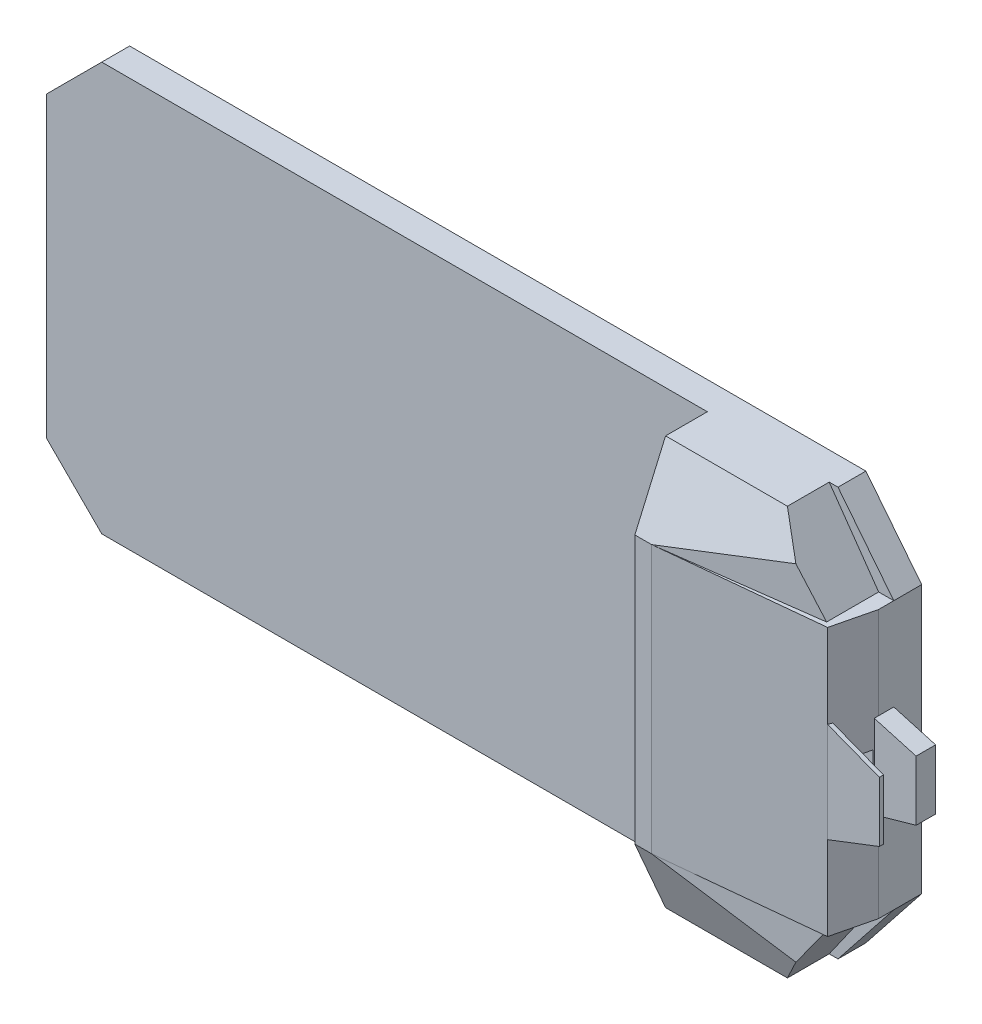
ISO-10303-21;
HEADER;
FILE_DESCRIPTION(('STEP AP214'),'2;1');
FILE_NAME('part.step','',(''),(''),'','','');
FILE_SCHEMA(('AUTOMOTIVE_DESIGN { 1 0 10303 214 1 1 1 1 }'));
ENDSEC;
DATA;
#1=APPLICATION_CONTEXT('core data for automotive mechanical design processes');
#2=APPLICATION_PROTOCOL_DEFINITION('international standard','automotive_design',2000,#1);
#3=PRODUCT_CONTEXT('',#1,'mechanical');
#4=PRODUCT('Part','Part','',(#3));
#5=PRODUCT_RELATED_PRODUCT_CATEGORY('part','',(#4));
#6=PRODUCT_DEFINITION_FORMATION('','',#4);
#7=PRODUCT_DEFINITION_CONTEXT('part definition',#1,'design');
#8=PRODUCT_DEFINITION('design','',#6,#7);
#9=PRODUCT_DEFINITION_SHAPE('','',#8);
#10=(LENGTH_UNIT() NAMED_UNIT(*) SI_UNIT(.MILLI.,.METRE.));
#11=(NAMED_UNIT(*) PLANE_ANGLE_UNIT() SI_UNIT($,.RADIAN.));
#12=(NAMED_UNIT(*) SI_UNIT($,.STERADIAN.) SOLID_ANGLE_UNIT());
#13=UNCERTAINTY_MEASURE_WITH_UNIT(LENGTH_MEASURE(1.E-05),#10,'distance_accuracy_value','');
#14=(GEOMETRIC_REPRESENTATION_CONTEXT(3) GLOBAL_UNCERTAINTY_ASSIGNED_CONTEXT((#13)) GLOBAL_UNIT_ASSIGNED_CONTEXT((#10,
#11,#12)) REPRESENTATION_CONTEXT('',''));
#15=CARTESIAN_POINT('',(0.,0.,0.));
#16=DIRECTION('',(0.,0.,1.));
#17=DIRECTION('',(1.,0.,0.));
#18=AXIS2_PLACEMENT_3D('',#15,#16,#17);
#19=CARTESIAN_POINT('',(1520.,480.,154.516976287061));
#20=DIRECTION('',(-0.971865662089476,0.,-0.235535846213236));
#21=DIRECTION('',(-0.235535846213236,0.,0.971865662089476));
#22=AXIS2_PLACEMENT_3D('',#19,#20,#21);
#23=PLANE('',#22);
#24=DIRECTION('',(-0.235535846213236,0.,0.971865662089476));
#25=VECTOR('',#24,1.);
#26=CARTESIAN_POINT('',(1520.,49.9999999999998,154.516976287061));
#27=LINE('',#26,#25);
#28=CARTESIAN_POINT('',(1516.24762224408,49.9999999999999,170.));
#29=VERTEX_POINT('',#28);
#30=CARTESIAN_POINT('',(1487.96391181185,50.,286.703964205424));
#31=VERTEX_POINT('',#30);
#32=EDGE_CURVE('E273',#29,#31,#27,.T.);
#33=ORIENTED_EDGE('',*,*,#32,.F.);
#34=DIRECTION('',(0.,-1.,0.));
#35=VECTOR('',#34,1.);
#36=CARTESIAN_POINT('',(1516.24762224408,480.,170.));
#37=LINE('',#36,#35);
#38=CARTESIAN_POINT('',(1516.24762224408,-50.0000000000001,170.));
#39=VERTEX_POINT('',#38);
#40=EDGE_CURVE('E282',#29,#39,#37,.T.);
#41=ORIENTED_EDGE('',*,*,#40,.T.);
#42=DIRECTION('',(0.235535846213236,0.,-0.971865662089476));
#43=VECTOR('',#42,1.);
#44=CARTESIAN_POINT('',(1520.,-50.0000000000002,154.516976287061));
#45=LINE('',#44,#43);
#46=CARTESIAN_POINT('',(1487.96391181185,-50.0000000000001,286.703964205424));
#47=VERTEX_POINT('',#46);
#48=EDGE_CURVE('E271',#47,#39,#45,.T.);
#49=ORIENTED_EDGE('',*,*,#48,.F.);
#50=DIRECTION('',(0.,1.,0.));
#51=VECTOR('',#50,1.);
#52=CARTESIAN_POINT('',(1487.96391181185,480.,286.703964205424));
#53=LINE('',#52,#51);
#54=CARTESIAN_POINT('',(1487.96391181185,-177.53371811243,286.703964205424));
#55=VERTEX_POINT('',#54);
#56=EDGE_CURVE('E266',#55,#47,#53,.T.);
#57=ORIENTED_EDGE('',*,*,#56,.F.);
#58=DIRECTION('',(-0.23457473015928,-0.0902466136895594,0.967899914602883));
#59=VECTOR('',#58,1.);
#60=CARTESIAN_POINT('',(1513.33600098474,-167.772457261663,182.013902632881));
#61=LINE('',#60,#59);
#62=CARTESIAN_POINT('',(1484.32859694169,-178.932312310983,301.703964205424));
#63=VERTEX_POINT('',#62);
#64=EDGE_CURVE('E383',#55,#63,#61,.T.);
#65=ORIENTED_EDGE('',*,*,#64,.T.);
#66=DIRECTION('',(0.,1.,0.));
#67=VECTOR('',#66,1.);
#68=CARTESIAN_POINT('',(1484.32859694169,-480.,301.703964205424));
#69=LINE('',#68,#67);
#70=CARTESIAN_POINT('',(1484.32859694169,-480.,301.703964205424));
#71=VERTEX_POINT('',#70);
#72=EDGE_CURVE('E341',#71,#63,#69,.T.);
#73=ORIENTED_EDGE('',*,*,#72,.F.);
#74=DIRECTION('',(0.235535846213236,0.,-0.971865662089476));
#75=VECTOR('',#74,1.);
#76=CARTESIAN_POINT('',(1520.,-480.,154.516976287061));
#77=LINE('',#76,#75);
#78=CARTESIAN_POINT('',(1520.,-480.,154.516976287061));
#79=VERTEX_POINT('',#78);
#80=EDGE_CURVE('E332',#71,#79,#77,.T.);
#81=ORIENTED_EDGE('',*,*,#80,.T.);
#82=DIRECTION('',(0.,1.,0.));
#83=VECTOR('',#82,1.);
#84=CARTESIAN_POINT('',(1520.,-480.,154.516976287061));
#85=LINE('',#84,#83);
#86=CARTESIAN_POINT('',(1520.,-150.,154.516976287061));
#87=VERTEX_POINT('',#86);
#88=EDGE_CURVE('E338',#79,#87,#85,.T.);
#89=ORIENTED_EDGE('',*,*,#88,.T.);
#90=DIRECTION('',(0.,-1.,0.));
#91=VECTOR('',#90,1.);
#92=CARTESIAN_POINT('',(1520.,480.,154.516976287061));
#93=LINE('',#92,#91);
#94=CARTESIAN_POINT('',(1520.,150.,154.516976287061));
#95=VERTEX_POINT('',#94);
#96=EDGE_CURVE('E449',#95,#87,#93,.T.);
#97=ORIENTED_EDGE('',*,*,#96,.F.);
#98=CARTESIAN_POINT('',(1520.,480.,154.516976287061));
#99=VERTEX_POINT('',#98);
#100=EDGE_CURVE('E450',#99,#95,#93,.T.);
#101=ORIENTED_EDGE('',*,*,#100,.F.);
#102=DIRECTION('',(0.235535846213236,0.,-0.971865662089476));
#103=VECTOR('',#102,1.);
#104=CARTESIAN_POINT('',(1520.,480.,154.516976287061));
#105=LINE('',#104,#103);
#106=CARTESIAN_POINT('',(1484.32859694169,480.,301.703964205424));
#107=VERTEX_POINT('',#106);
#108=EDGE_CURVE('E444',#107,#99,#105,.T.);
#109=ORIENTED_EDGE('',*,*,#108,.F.);
#110=DIRECTION('',(0.,-1.,0.));
#111=VECTOR('',#110,1.);
#112=CARTESIAN_POINT('',(1484.32859694169,480.,301.703964205424));
#113=LINE('',#112,#111);
#114=CARTESIAN_POINT('',(1484.32859694169,178.932312310983,301.703964205424));
#115=VERTEX_POINT('',#114);
#116=EDGE_CURVE('E454',#107,#115,#113,.T.);
#117=ORIENTED_EDGE('',*,*,#116,.T.);
#118=DIRECTION('',(-0.23457473015928,0.0902466136895594,0.967899914602883));
#119=VECTOR('',#118,1.);
#120=CARTESIAN_POINT('',(1513.33600098474,167.772457261663,182.013902632881));
#121=LINE('',#120,#119);
#122=CARTESIAN_POINT('',(1487.96391181185,177.53371811243,286.703964205424));
#123=VERTEX_POINT('',#122);
#124=EDGE_CURVE('E48',#123,#115,#121,.T.);
#125=ORIENTED_EDGE('',*,*,#124,.F.);
#126=EDGE_CURVE('E505',#31,#123,#53,.T.);
#127=ORIENTED_EDGE('',*,*,#126,.F.);
#128=EDGE_LOOP('',(#33,#41,#49,#57,#65,#73,#81,#89,#97,#101,#109,#117,#125,#127));
#129=FACE_BOUND('',#128,.T.);
#130=ADVANCED_FACE('F40',(#129),#23,.F.);
#131=CARTESIAN_POINT('',(-1320.,732.5,100.));
#132=DIRECTION('',(0.,-1.,0.));
#133=DIRECTION('',(1.,0.,0.));
#134=AXIS2_PLACEMENT_3D('',#131,#132,#133);
#135=PLANE('',#134);
#136=DIRECTION('',(-1.,0.,0.));
#137=VECTOR('',#136,1.);
#138=CARTESIAN_POINT('',(-1320.,732.5,100.));
#139=LINE('',#138,#137);
#140=CARTESIAN_POINT('',(1320.,732.5,100.));
#141=VERTEX_POINT('',#140);
#142=CARTESIAN_POINT('',(1288.45260963228,732.5,100.));
#143=VERTEX_POINT('',#142);
#144=EDGE_CURVE('E391',#141,#143,#139,.T.);
#145=ORIENTED_EDGE('',*,*,#144,.F.);
#146=DIRECTION('',(0.,0.,-1.));
#147=VECTOR('',#146,1.);
#148=CARTESIAN_POINT('',(1320.,732.5,100.));
#149=LINE('',#148,#147);
#150=CARTESIAN_POINT('',(1320.,732.5,0.));
#151=VERTEX_POINT('',#150);
#152=EDGE_CURVE('E499',#141,#151,#149,.T.);
#153=ORIENTED_EDGE('',*,*,#152,.T.);
#154=DIRECTION('',(-1.,0.,0.));
#155=VECTOR('',#154,1.);
#156=CARTESIAN_POINT('',(-1320.,732.5,0.));
#157=LINE('',#156,#155);
#158=CARTESIAN_POINT('',(-1320.,732.5,0.));
#159=VERTEX_POINT('',#158);
#160=EDGE_CURVE('E489',#151,#159,#157,.T.);
#161=ORIENTED_EDGE('',*,*,#160,.T.);
#162=DIRECTION('',(0.,0.,-1.));
#163=VECTOR('',#162,1.);
#164=CARTESIAN_POINT('',(-1320.,732.5,100.));
#165=LINE('',#164,#163);
#166=CARTESIAN_POINT('',(-1320.,732.5,100.));
#167=VERTEX_POINT('',#166);
#168=EDGE_CURVE('E496',#167,#159,#165,.T.);
#169=ORIENTED_EDGE('',*,*,#168,.F.);
#170=DIRECTION('',(-1.,0.,0.));
#171=VECTOR('',#170,1.);
#172=CARTESIAN_POINT('',(-1320.,732.5,100.));
#173=LINE('',#172,#171);
#174=CARTESIAN_POINT('',(851.501728060093,732.5,100.));
#175=VERTEX_POINT('',#174);
#176=EDGE_CURVE('E478',#175,#167,#173,.T.);
#177=ORIENTED_EDGE('',*,*,#176,.F.);
#178=DIRECTION('',(0.,0.,-1.));
#179=VECTOR('',#178,1.);
#180=CARTESIAN_POINT('',(851.501728060093,732.5,100.));
#181=LINE('',#180,#179);
#182=CARTESIAN_POINT('',(851.501728060093,732.5,249.797915184111));
#183=VERTEX_POINT('',#182);
#184=EDGE_CURVE('E465',#183,#175,#181,.T.);
#185=ORIENTED_EDGE('',*,*,#184,.F.);
#186=DIRECTION('',(1.,0.,0.));
#187=VECTOR('',#186,1.);
#188=CARTESIAN_POINT('',(851.501728060093,732.5,249.797915184111));
#189=LINE('',#188,#187);
#190=CARTESIAN_POINT('',(1288.45260963228,732.5,249.797915184111));
#191=VERTEX_POINT('',#190);
#192=EDGE_CURVE('E468',#183,#191,#189,.T.);
#193=ORIENTED_EDGE('',*,*,#192,.T.);
#194=DIRECTION('',(0.,0.,-1.));
#195=VECTOR('',#194,1.);
#196=CARTESIAN_POINT('',(1288.45260963228,732.5,100.));
#197=LINE('',#196,#195);
#198=EDGE_CURVE('E388',#191,#143,#197,.T.);
#199=ORIENTED_EDGE('',*,*,#198,.T.);
#200=EDGE_LOOP('',(#145,#153,#161,#169,#177,#185,#193,#199));
#201=FACE_BOUND('',#200,.T.);
#202=ADVANCED_FACE('F567',(#201),#135,.F.);
#203=CARTESIAN_POINT('',(911.501728060093,-52.630105545599,360.));
#204=DIRECTION('',(0.131250564674008,0.,0.991349226697007));
#205=DIRECTION('',(0.991349226697007,0.,-0.131250564674008));
#206=AXIS2_PLACEMENT_3D('',#203,#204,#205);
#207=PLANE('',#206);
#208=DIRECTION('',(-0.573075323615634,0.815982836151826,0.0758728183769296));
#209=VECTOR('',#208,1.);
#210=CARTESIAN_POINT('',(1319.48402387466,688.315404433155,305.984820222162));
#211=LINE('',#210,#209);
#212=CARTESIAN_POINT('',(1465.78663285189,480.,286.614955875245));
#213=VERTEX_POINT('',#212);
#214=CARTESIAN_POINT('',(1368.43753024182,618.612139750538,299.50357710376));
#215=VERTEX_POINT('',#214);
#216=EDGE_CURVE('E400',#213,#215,#211,.T.);
#217=ORIENTED_EDGE('',*,*,#216,.T.);
#218=DIRECTION('',(-0.949350118996953,-0.287986738483361,0.125690055367108));
#219=VECTOR('',#218,1.);
#220=CARTESIAN_POINT('',(765.880527003177,435.825596998165,379.27964873782));
#221=LINE('',#220,#219);
#222=CARTESIAN_POINT('',(911.501728060093,480.,360.));
#223=VERTEX_POINT('',#222);
#224=EDGE_CURVE('E394',#215,#223,#221,.T.);
#225=ORIENTED_EDGE('',*,*,#224,.T.);
#226=DIRECTION('',(-0.991349226697007,0.,0.131250564674008));
#227=VECTOR('',#226,1.);
#228=CARTESIAN_POINT('',(911.501728060093,480.,360.));
#229=LINE('',#228,#227);
#230=EDGE_CURVE('E402',#213,#223,#229,.T.);
#231=ORIENTED_EDGE('',*,*,#230,.F.);
#232=EDGE_LOOP('',(#217,#225,#231));
#233=FACE_BOUND('',#232,.T.);
#234=ADVANCED_FACE('F572',(#233),#207,.T.);
#235=CARTESIAN_POINT('',(1329.4509606788,674.123815603474,533.891187840252));
#236=DIRECTION('',(-0.818341703393144,-0.574731986657788,0.));
#237=DIRECTION('',(0.574731986657788,-0.818341703393144,0.));
#238=AXIS2_PLACEMENT_3D('',#235,#236,#237);
#239=PLANE('',#238);
#240=DIRECTION('',(-0.541246218848826,0.770662435657294,-0.336350919202871));
#241=VECTOR('',#240,1.);
#242=CARTESIAN_POINT('',(1376.53153817155,607.087351866355,304.533500477613));
#243=LINE('',#242,#241);
#244=EDGE_CURVE('E11',#215,#191,#243,.T.);
#245=ORIENTED_EDGE('',*,*,#244,.F.);
#246=ORIENTED_EDGE('',*,*,#216,.F.);
#247=DIRECTION('',(0.,0.,-1.));
#248=VECTOR('',#247,1.);
#249=CARTESIAN_POINT('',(1465.78663285189,480.,533.891187840252));
#250=LINE('',#249,#248);
#251=CARTESIAN_POINT('',(1465.78663285189,480.,100.));
#252=VERTEX_POINT('',#251);
#253=EDGE_CURVE('E397',#213,#252,#250,.T.);
#254=ORIENTED_EDGE('',*,*,#253,.T.);
#255=DIRECTION('',(-0.574731986657788,0.818341703393144,0.));
#256=VECTOR('',#255,1.);
#257=CARTESIAN_POINT('',(1329.4509606788,674.123815603474,100.));
#258=LINE('',#257,#256);
#259=EDGE_CURVE('E398',#252,#143,#258,.T.);
#260=ORIENTED_EDGE('',*,*,#259,.T.);
#261=ORIENTED_EDGE('',*,*,#198,.F.);
#262=EDGE_LOOP('',(#245,#246,#254,#260,#261));
#263=FACE_BOUND('',#262,.T.);
#264=ADVANCED_FACE('F596',(#263),#239,.F.);
#265=CARTESIAN_POINT('',(0.,0.,100.));
#266=DIRECTION('',(0.,0.,-1.));
#267=DIRECTION('',(-1.,0.,0.));
#268=AXIS2_PLACEMENT_3D('',#265,#266,#267);
#269=PLANE('',#268);
#270=ORIENTED_EDGE('',*,*,#144,.T.);
#271=ORIENTED_EDGE('',*,*,#259,.F.);
#272=DIRECTION('',(-1.,0.,0.));
#273=VECTOR('',#272,1.);
#274=CARTESIAN_POINT('',(1520.,480.,100.));
#275=LINE('',#274,#273);
#276=CARTESIAN_POINT('',(1520.,480.,100.));
#277=VERTEX_POINT('',#276);
#278=EDGE_CURVE('E439',#277,#252,#275,.T.);
#279=ORIENTED_EDGE('',*,*,#278,.F.);
#280=DIRECTION('',(-0.620901718987707,0.78388842022198,0.));
#281=VECTOR('',#280,1.);
#282=CARTESIAN_POINT('',(1320.,732.5,100.));
#283=LINE('',#282,#281);
#284=EDGE_CURVE('E476',#277,#141,#283,.T.);
#285=ORIENTED_EDGE('',*,*,#284,.T.);
#286=EDGE_LOOP('',(#270,#271,#279,#285));
#287=FACE_BOUND('',#286,.T.);
#288=ADVANCED_FACE('F593',(#287),#269,.F.);
#289=CARTESIAN_POINT('',(0.,480.,0.));
#290=DIRECTION('',(0.,1.,0.));
#291=DIRECTION('',(-1.,0.,0.));
#292=AXIS2_PLACEMENT_3D('',#289,#290,#291);
#293=PLANE('',#292);
#294=ORIENTED_EDGE('',*,*,#278,.T.);
#295=ORIENTED_EDGE('',*,*,#253,.F.);
#296=ORIENTED_EDGE('',*,*,#230,.T.);
#297=DIRECTION('',(0.994861412831059,0.,-0.101246082688607));
#298=VECTOR('',#297,1.);
#299=CARTESIAN_POINT('',(1484.32859694169,480.,301.703964205424));
#300=LINE('',#299,#298);
#301=EDGE_CURVE('E442',#223,#107,#300,.T.);
#302=ORIENTED_EDGE('',*,*,#301,.T.);
#303=ORIENTED_EDGE('',*,*,#108,.T.);
#304=DIRECTION('',(0.,0.,-1.));
#305=VECTOR('',#304,1.);
#306=CARTESIAN_POINT('',(1520.,480.,100.));
#307=LINE('',#306,#305);
#308=EDGE_CURVE('E446',#99,#277,#307,.T.);
#309=ORIENTED_EDGE('',*,*,#308,.T.);
#310=EDGE_LOOP('',(#294,#295,#296,#302,#303,#309));
#311=FACE_BOUND('',#310,.T.);
#312=ADVANCED_FACE('F577',(#311),#293,.T.);
#313=CARTESIAN_POINT('',(1520.,480.,100.));
#314=DIRECTION('',(-1.,0.,0.));
#315=DIRECTION('',(0.,0.,1.));
#316=AXIS2_PLACEMENT_3D('',#313,#314,#315);
#317=PLANE('',#316);
#318=DIRECTION('',(0.,-1.,0.));
#319=VECTOR('',#318,1.);
#320=CARTESIAN_POINT('',(1520.,-150.,100.));
#321=LINE('',#320,#319);
#322=CARTESIAN_POINT('',(1520.,150.,100.));
#323=VERTEX_POINT('',#322);
#324=CARTESIAN_POINT('',(1520.,-150.,100.));
#325=VERTEX_POINT('',#324);
#326=EDGE_CURVE('E419',#323,#325,#321,.T.);
#327=ORIENTED_EDGE('',*,*,#326,.T.);
#328=DIRECTION('',(0.,0.,-1.));
#329=VECTOR('',#328,1.);
#330=CARTESIAN_POINT('',(1520.,-150.,170.));
#331=LINE('',#330,#329);
#332=EDGE_CURVE('E324',#87,#325,#331,.T.);
#333=ORIENTED_EDGE('',*,*,#332,.F.);
#334=ORIENTED_EDGE('',*,*,#88,.F.);
#335=DIRECTION('',(0.,0.,-1.));
#336=VECTOR('',#335,1.);
#337=CARTESIAN_POINT('',(1520.,-480.,100.));
#338=LINE('',#337,#336);
#339=CARTESIAN_POINT('',(1520.,-480.,100.));
#340=VERTEX_POINT('',#339);
#341=EDGE_CURVE('E335',#79,#340,#338,.T.);
#342=ORIENTED_EDGE('',*,*,#341,.T.);
#343=DIRECTION('',(0.,0.,-1.));
#344=VECTOR('',#343,1.);
#345=CARTESIAN_POINT('',(1520.,-480.,100.));
#346=LINE('',#345,#344);
#347=CARTESIAN_POINT('',(1520.,-480.,0.));
#348=VERTEX_POINT('',#347);
#349=EDGE_CURVE('E380',#340,#348,#346,.T.);
#350=ORIENTED_EDGE('',*,*,#349,.T.);
#351=DIRECTION('',(0.,1.,0.));
#352=VECTOR('',#351,1.);
#353=CARTESIAN_POINT('',(1520.,480.,0.));
#354=LINE('',#353,#352);
#355=CARTESIAN_POINT('',(1520.,480.,0.));
#356=VERTEX_POINT('',#355);
#357=EDGE_CURVE('E475',#348,#356,#354,.T.);
#358=ORIENTED_EDGE('',*,*,#357,.T.);
#359=DIRECTION('',(0.,0.,-1.));
#360=VECTOR('',#359,1.);
#361=CARTESIAN_POINT('',(1520.,480.,100.));
#362=LINE('',#361,#360);
#363=EDGE_CURVE('E502',#277,#356,#362,.T.);
#364=ORIENTED_EDGE('',*,*,#363,.F.);
#365=ORIENTED_EDGE('',*,*,#308,.F.);
#366=ORIENTED_EDGE('',*,*,#100,.T.);
#367=DIRECTION('',(0.,0.,-1.));
#368=VECTOR('',#367,1.);
#369=CARTESIAN_POINT('',(1520.,150.,170.));
#370=LINE('',#369,#368);
#371=EDGE_CURVE('E436',#95,#323,#370,.T.);
#372=ORIENTED_EDGE('',*,*,#371,.T.);
#373=EDGE_LOOP('',(#327,#333,#334,#342,#350,#358,#364,#365,#366,#372));
#374=FACE_BOUND('',#373,.T.);
#375=ADVANCED_FACE('F42',(#374),#317,.F.);
#376=DIRECTION('',(0.,-1.,0.));
#377=VECTOR('',#376,1.);
#378=CARTESIAN_POINT('',(-1518.49827193991,-534.001728060093,100.));
#379=LINE('',#378,#377);
#380=CARTESIAN_POINT('',(-1518.49827193991,534.001728060093,100.));
#381=VERTEX_POINT('',#380);
#382=CARTESIAN_POINT('',(-1518.49827193991,-534.001728060093,100.));
#383=VERTEX_POINT('',#382);
#384=EDGE_CURVE('E483',#381,#383,#379,.T.);
#385=ORIENTED_EDGE('',*,*,#384,.T.);
#386=DIRECTION('',(-0.707106781186547,0.707106781186548,0.));
#387=VECTOR('',#386,1.);
#388=CARTESIAN_POINT('',(-1518.49827193991,-534.001728060093,100.));
#389=LINE('',#388,#387);
#390=CARTESIAN_POINT('',(-1320.,-732.5,100.));
#391=VERTEX_POINT('',#390);
#392=EDGE_CURVE('E362',#391,#383,#389,.T.);
#393=ORIENTED_EDGE('',*,*,#392,.F.);
#394=DIRECTION('',(-1.,0.,0.));
#395=VECTOR('',#394,1.);
#396=CARTESIAN_POINT('',(-1320.,-732.5,100.));
#397=LINE('',#396,#395);
#398=CARTESIAN_POINT('',(851.501728060093,-732.5,100.));
#399=VERTEX_POINT('',#398);
#400=EDGE_CURVE('E358',#399,#391,#397,.T.);
#401=ORIENTED_EDGE('',*,*,#400,.F.);
#402=DIRECTION('',(0.,-1.,0.));
#403=VECTOR('',#402,1.);
#404=CARTESIAN_POINT('',(851.501728060093,732.5,100.));
#405=LINE('',#404,#403);
#406=EDGE_CURVE('E459',#175,#399,#405,.T.);
#407=ORIENTED_EDGE('',*,*,#406,.F.);
#408=ORIENTED_EDGE('',*,*,#176,.T.);
#409=DIRECTION('',(-0.707106781186547,-0.707106781186548,0.));
#410=VECTOR('',#409,1.);
#411=CARTESIAN_POINT('',(-1518.49827193991,534.001728060093,100.));
#412=LINE('',#411,#410);
#413=EDGE_CURVE('E481',#167,#381,#412,.T.);
#414=ORIENTED_EDGE('',*,*,#413,.T.);
#415=EDGE_LOOP('',(#385,#393,#401,#407,#408,#414));
#416=FACE_BOUND('',#415,.T.);
#417=ADVANCED_FACE('F598',(#416),#269,.F.);
#418=CARTESIAN_POINT('',(1320.,732.5,100.));
#419=DIRECTION('',(-0.78388842022198,-0.620901718987707,0.));
#420=DIRECTION('',(0.620901718987707,-0.78388842022198,0.));
#421=AXIS2_PLACEMENT_3D('',#418,#419,#420);
#422=PLANE('',#421);
#423=DIRECTION('',(-0.620901718987707,0.78388842022198,0.));
#424=VECTOR('',#423,1.);
#425=CARTESIAN_POINT('',(1320.,732.5,0.));
#426=LINE('',#425,#424);
#427=EDGE_CURVE('E487',#356,#151,#426,.T.);
#428=ORIENTED_EDGE('',*,*,#427,.T.);
#429=ORIENTED_EDGE('',*,*,#152,.F.);
#430=ORIENTED_EDGE('',*,*,#284,.F.);
#431=ORIENTED_EDGE('',*,*,#363,.T.);
#432=EDGE_LOOP('',(#428,#429,#430,#431));
#433=FACE_BOUND('',#432,.T.);
#434=ADVANCED_FACE('F608',(#433),#422,.F.);
#435=CARTESIAN_POINT('',(-1518.49827193991,534.001728060093,100.));
#436=DIRECTION('',(0.707106781186548,-0.707106781186547,0.));
#437=DIRECTION('',(0.707106781186547,0.707106781186548,0.));
#438=AXIS2_PLACEMENT_3D('',#435,#436,#437);
#439=PLANE('',#438);
#440=DIRECTION('',(-0.707106781186547,-0.707106781186548,0.));
#441=VECTOR('',#440,1.);
#442=CARTESIAN_POINT('',(-1518.49827193991,534.001728060093,0.));
#443=LINE('',#442,#441);
#444=CARTESIAN_POINT('',(-1518.49827193991,534.001728060093,0.));
#445=VERTEX_POINT('',#444);
#446=EDGE_CURVE('E491',#159,#445,#443,.T.);
#447=ORIENTED_EDGE('',*,*,#446,.T.);
#448=DIRECTION('',(0.,0.,-1.));
#449=VECTOR('',#448,1.);
#450=CARTESIAN_POINT('',(-1518.49827193991,534.001728060093,100.));
#451=LINE('',#450,#449);
#452=EDGE_CURVE('E485',#381,#445,#451,.T.);
#453=ORIENTED_EDGE('',*,*,#452,.F.);
#454=ORIENTED_EDGE('',*,*,#413,.F.);
#455=ORIENTED_EDGE('',*,*,#168,.T.);
#456=EDGE_LOOP('',(#447,#453,#454,#455));
#457=FACE_BOUND('',#456,.T.);
#458=ADVANCED_FACE('F605',(#457),#439,.F.);
#459=CARTESIAN_POINT('',(-1518.49827193991,-534.001728060093,100.));
#460=DIRECTION('',(1.,0.,0.));
#461=DIRECTION('',(0.,1.,0.));
#462=AXIS2_PLACEMENT_3D('',#459,#460,#461);
#463=PLANE('',#462);
#464=DIRECTION('',(0.,-1.,0.));
#465=VECTOR('',#464,1.);
#466=CARTESIAN_POINT('',(-1518.49827193991,-534.001728060093,0.));
#467=LINE('',#466,#465);
#468=CARTESIAN_POINT('',(-1518.49827193991,-534.001728060093,0.));
#469=VERTEX_POINT('',#468);
#470=EDGE_CURVE('E479',#445,#469,#467,.T.);
#471=ORIENTED_EDGE('',*,*,#470,.T.);
#472=DIRECTION('',(0.,0.,-1.));
#473=VECTOR('',#472,1.);
#474=CARTESIAN_POINT('',(-1518.49827193991,-534.001728060093,100.));
#475=LINE('',#474,#473);
#476=EDGE_CURVE('E365',#383,#469,#475,.T.);
#477=ORIENTED_EDGE('',*,*,#476,.F.);
#478=ORIENTED_EDGE('',*,*,#384,.F.);
#479=ORIENTED_EDGE('',*,*,#452,.T.);
#480=EDGE_LOOP('',(#471,#477,#478,#479));
#481=FACE_BOUND('',#480,.T.);
#482=ADVANCED_FACE('F601',(#481),#463,.F.);
#483=CARTESIAN_POINT('',(0.,0.,0.));
#484=DIRECTION('',(0.,0.,-1.));
#485=DIRECTION('',(-1.,0.,0.));
#486=AXIS2_PLACEMENT_3D('',#483,#484,#485);
#487=PLANE('',#486);
#488=ORIENTED_EDGE('',*,*,#357,.F.);
#489=DIRECTION('',(-0.620901718987707,-0.78388842022198,0.));
#490=VECTOR('',#489,1.);
#491=CARTESIAN_POINT('',(1320.,-732.5,0.));
#492=LINE('',#491,#490);
#493=CARTESIAN_POINT('',(1320.,-732.5,0.));
#494=VERTEX_POINT('',#493);
#495=EDGE_CURVE('E355',#348,#494,#492,.T.);
#496=ORIENTED_EDGE('',*,*,#495,.T.);
#497=DIRECTION('',(-1.,0.,0.));
#498=VECTOR('',#497,1.);
#499=CARTESIAN_POINT('',(-1320.,-732.5,0.));
#500=LINE('',#499,#498);
#501=CARTESIAN_POINT('',(-1320.,-732.5,0.));
#502=VERTEX_POINT('',#501);
#503=EDGE_CURVE('E367',#494,#502,#500,.T.);
#504=ORIENTED_EDGE('',*,*,#503,.T.);
#505=DIRECTION('',(-0.707106781186547,0.707106781186548,0.));
#506=VECTOR('',#505,1.);
#507=CARTESIAN_POINT('',(-1518.49827193991,-534.001728060093,0.));
#508=LINE('',#507,#506);
#509=EDGE_CURVE('E359',#502,#469,#508,.T.);
#510=ORIENTED_EDGE('',*,*,#509,.T.);
#511=ORIENTED_EDGE('',*,*,#470,.F.);
#512=ORIENTED_EDGE('',*,*,#446,.F.);
#513=ORIENTED_EDGE('',*,*,#160,.F.);
#514=ORIENTED_EDGE('',*,*,#427,.F.);
#515=EDGE_LOOP('',(#488,#496,#504,#510,#511,#512,#513,#514));
#516=FACE_BOUND('',#515,.T.);
#517=ADVANCED_FACE('F591',(#516),#487,.T.);
#518=CARTESIAN_POINT('',(851.501728060093,-480.,360.));
#519=DIRECTION('',(0.,0.,-1.));
#520=DIRECTION('',(-1.,0.,0.));
#521=AXIS2_PLACEMENT_3D('',#518,#519,#520);
#522=PLANE('',#521);
#523=DIRECTION('',(0.,1.,0.));
#524=VECTOR('',#523,1.);
#525=CARTESIAN_POINT('',(851.501728060093,-480.,360.));
#526=LINE('',#525,#524);
#527=CARTESIAN_POINT('',(851.501728060093,-480.,360.));
#528=VERTEX_POINT('',#527);
#529=CARTESIAN_POINT('',(851.501728060093,480.,360.));
#530=VERTEX_POINT('',#529);
#531=EDGE_CURVE('E461',#528,#530,#526,.T.);
#532=ORIENTED_EDGE('',*,*,#531,.F.);
#533=DIRECTION('',(1.,0.,0.));
#534=VECTOR('',#533,1.);
#535=CARTESIAN_POINT('',(851.501728060093,-480.,360.));
#536=LINE('',#535,#534);
#537=CARTESIAN_POINT('',(911.501728060093,-480.,360.));
#538=VERTEX_POINT('',#537);
#539=EDGE_CURVE('E352',#528,#538,#536,.T.);
#540=ORIENTED_EDGE('',*,*,#539,.T.);
#541=DIRECTION('',(0.,1.,0.));
#542=VECTOR('',#541,1.);
#543=CARTESIAN_POINT('',(911.501728060093,-480.,360.));
#544=LINE('',#543,#542);
#545=EDGE_CURVE('E458',#538,#223,#544,.T.);
#546=ORIENTED_EDGE('',*,*,#545,.T.);
#547=DIRECTION('',(1.,0.,0.));
#548=VECTOR('',#547,1.);
#549=CARTESIAN_POINT('',(851.501728060093,480.,360.));
#550=LINE('',#549,#548);
#551=EDGE_CURVE('E472',#530,#223,#550,.T.);
#552=ORIENTED_EDGE('',*,*,#551,.F.);
#553=EDGE_LOOP('',(#532,#540,#546,#552));
#554=FACE_BOUND('',#553,.T.);
#555=ADVANCED_FACE('F588',(#554),#522,.F.);
#556=CARTESIAN_POINT('',(851.501728060093,480.,360.));
#557=DIRECTION('',(0.,-0.400006251176076,-0.916512410728879));
#558=DIRECTION('',(0.,0.916512410728879,-0.400006251176076));
#559=AXIS2_PLACEMENT_3D('',#556,#557,#558);
#560=PLANE('',#559);
#561=ORIENTED_EDGE('',*,*,#244,.T.);
#562=ORIENTED_EDGE('',*,*,#192,.F.);
#563=DIRECTION('',(0.,0.916512410728879,-0.400006251176076));
#564=VECTOR('',#563,1.);
#565=CARTESIAN_POINT('',(851.501728060093,480.,360.));
#566=LINE('',#565,#564);
#567=EDGE_CURVE('E463',#530,#183,#566,.T.);
#568=ORIENTED_EDGE('',*,*,#567,.F.);
#569=ORIENTED_EDGE('',*,*,#551,.T.);
#570=ORIENTED_EDGE('',*,*,#224,.F.);
#571=EDGE_LOOP('',(#561,#562,#568,#569,#570));
#572=FACE_BOUND('',#571,.T.);
#573=ADVANCED_FACE('F584',(#572),#560,.F.);
#574=CARTESIAN_POINT('',(851.501728060093,-1.27368752759177E-13,0.));
#575=DIRECTION('',(-1.,0.,0.));
#576=DIRECTION('',(0.,-1.,0.));
#577=AXIS2_PLACEMENT_3D('',#574,#575,#576);
#578=PLANE('',#577);
#579=ORIENTED_EDGE('',*,*,#406,.T.);
#580=DIRECTION('',(0.,0.,-1.));
#581=VECTOR('',#580,1.);
#582=CARTESIAN_POINT('',(851.501728060093,-732.5,100.));
#583=LINE('',#582,#581);
#584=CARTESIAN_POINT('',(851.501728060093,-732.5,249.797915184111));
#585=VERTEX_POINT('',#584);
#586=EDGE_CURVE('E346',#585,#399,#583,.T.);
#587=ORIENTED_EDGE('',*,*,#586,.F.);
#588=DIRECTION('',(0.,-0.916512410728879,-0.400006251176076));
#589=VECTOR('',#588,1.);
#590=CARTESIAN_POINT('',(851.501728060093,-480.,360.));
#591=LINE('',#590,#589);
#592=EDGE_CURVE('E344',#528,#585,#591,.T.);
#593=ORIENTED_EDGE('',*,*,#592,.F.);
#594=ORIENTED_EDGE('',*,*,#531,.T.);
#595=ORIENTED_EDGE('',*,*,#567,.T.);
#596=ORIENTED_EDGE('',*,*,#184,.T.);
#597=EDGE_LOOP('',(#579,#587,#593,#594,#595,#596));
#598=FACE_BOUND('',#597,.T.);
#599=ADVANCED_FACE('F580',(#598),#578,.T.);
#600=CARTESIAN_POINT('',(1484.32859694169,480.,301.703964205424));
#601=DIRECTION('',(-0.101246082688607,0.,-0.99486141283106));
#602=DIRECTION('',(-0.99486141283106,0.,0.101246082688607));
#603=AXIS2_PLACEMENT_3D('',#600,#601,#602);
#604=PLANE('',#603);
#605=ORIENTED_EDGE('',*,*,#545,.F.);
#606=DIRECTION('',(0.994861412831059,0.,-0.101246082688607));
#607=VECTOR('',#606,1.);
#608=CARTESIAN_POINT('',(1484.32859694169,-480.,301.703964205424));
#609=LINE('',#608,#607);
#610=EDGE_CURVE('E329',#538,#71,#609,.T.);
#611=ORIENTED_EDGE('',*,*,#610,.T.);
#612=ORIENTED_EDGE('',*,*,#72,.T.);
#613=DIRECTION('',(0.,1.,0.));
#614=VECTOR('',#613,1.);
#615=CARTESIAN_POINT('',(1484.32859694169,-159.754145476495,301.703964205424));
#616=LINE('',#615,#614);
#617=EDGE_CURVE('E406',#63,#115,#616,.T.);
#618=ORIENTED_EDGE('',*,*,#617,.T.);
#619=ORIENTED_EDGE('',*,*,#116,.F.);
#620=ORIENTED_EDGE('',*,*,#301,.F.);
#621=EDGE_LOOP('',(#605,#611,#612,#618,#619,#620));
#622=FACE_BOUND('',#621,.T.);
#623=ADVANCED_FACE('F564',(#622),#604,.F.);
#624=CARTESIAN_POINT('',(1520.,-150.,170.));
#625=DIRECTION('',(1.,0.,0.));
#626=DIRECTION('',(0.,0.,-1.));
#627=AXIS2_PLACEMENT_3D('',#624,#625,#626);
#628=PLANE('',#627);
#629=ORIENTED_EDGE('',*,*,#96,.T.);
#630=CARTESIAN_POINT('',(1520.,-150.,170.));
#631=VERTEX_POINT('',#630);
#632=EDGE_CURVE('E318',#631,#87,#331,.T.);
#633=ORIENTED_EDGE('',*,*,#632,.F.);
#634=DIRECTION('',(0.,-1.,0.));
#635=VECTOR('',#634,1.);
#636=CARTESIAN_POINT('',(1520.,-150.,170.));
#637=LINE('',#636,#635);
#638=CARTESIAN_POINT('',(1520.,150.,170.));
#639=VERTEX_POINT('',#638);
#640=EDGE_CURVE('E420',#639,#631,#637,.T.);
#641=ORIENTED_EDGE('',*,*,#640,.F.);
#642=EDGE_CURVE('E427',#639,#95,#370,.T.);
#643=ORIENTED_EDGE('',*,*,#642,.T.);
#644=EDGE_LOOP('',(#629,#633,#641,#643));
#645=FACE_BOUND('',#644,.T.);
#646=ADVANCED_FACE('F538',(#645),#628,.F.);
#647=CARTESIAN_POINT('',(1670.,107.5,170.));
#648=DIRECTION('',(-1.,0.,0.));
#649=DIRECTION('',(0.,0.,1.));
#650=AXIS2_PLACEMENT_3D('',#647,#648,#649);
#651=PLANE('',#650);
#652=DIRECTION('',(0.,1.,0.));
#653=VECTOR('',#652,1.);
#654=CARTESIAN_POINT('',(1670.,107.5,170.));
#655=LINE('',#654,#653);
#656=CARTESIAN_POINT('',(1670.,-107.5,170.));
#657=VERTEX_POINT('',#656);
#658=CARTESIAN_POINT('',(1670.,107.5,170.));
#659=VERTEX_POINT('',#658);
#660=EDGE_CURVE('E422',#657,#659,#655,.T.);
#661=ORIENTED_EDGE('',*,*,#660,.F.);
#662=DIRECTION('',(0.,0.,-1.));
#663=VECTOR('',#662,1.);
#664=CARTESIAN_POINT('',(1670.,-107.5,170.));
#665=LINE('',#664,#663);
#666=CARTESIAN_POINT('',(1670.,-107.5,100.));
#667=VERTEX_POINT('',#666);
#668=EDGE_CURVE('E323',#657,#667,#665,.T.);
#669=ORIENTED_EDGE('',*,*,#668,.T.);
#670=DIRECTION('',(0.,1.,0.));
#671=VECTOR('',#670,1.);
#672=CARTESIAN_POINT('',(1670.,107.5,100.));
#673=LINE('',#672,#671);
#674=CARTESIAN_POINT('',(1670.,107.5,100.));
#675=VERTEX_POINT('',#674);
#676=EDGE_CURVE('E429',#667,#675,#673,.T.);
#677=ORIENTED_EDGE('',*,*,#676,.T.);
#678=DIRECTION('',(0.,0.,-1.));
#679=VECTOR('',#678,1.);
#680=CARTESIAN_POINT('',(1670.,107.5,170.));
#681=LINE('',#680,#679);
#682=EDGE_CURVE('E435',#659,#675,#681,.T.);
#683=ORIENTED_EDGE('',*,*,#682,.F.);
#684=EDGE_LOOP('',(#661,#669,#677,#683));
#685=FACE_BOUND('',#684,.T.);
#686=ADVANCED_FACE('F556',(#685),#651,.F.);
#687=CARTESIAN_POINT('',(1520.,150.,170.));
#688=DIRECTION('',(-0.272602572456025,-0.962126726315384,0.));
#689=DIRECTION('',(0.962126726315384,-0.272602572456025,0.));
#690=AXIS2_PLACEMENT_3D('',#687,#688,#689);
#691=PLANE('',#690);
#692=DIRECTION('',(-0.962126726315384,0.272602572456025,0.));
#693=VECTOR('',#692,1.);
#694=CARTESIAN_POINT('',(1520.,150.,100.));
#695=LINE('',#694,#693);
#696=EDGE_CURVE('E423',#675,#323,#695,.T.);
#697=ORIENTED_EDGE('',*,*,#696,.T.);
#698=ORIENTED_EDGE('',*,*,#371,.F.);
#699=ORIENTED_EDGE('',*,*,#642,.F.);
#700=DIRECTION('',(-0.962126726315384,0.272602572456025,0.));
#701=VECTOR('',#700,1.);
#702=CARTESIAN_POINT('',(1520.,150.,170.));
#703=LINE('',#702,#701);
#704=EDGE_CURVE('E425',#659,#639,#703,.T.);
#705=ORIENTED_EDGE('',*,*,#704,.F.);
#706=ORIENTED_EDGE('',*,*,#682,.T.);
#707=EDGE_LOOP('',(#697,#698,#699,#705,#706));
#708=FACE_BOUND('',#707,.T.);
#709=ADVANCED_FACE('F532',(#708),#691,.F.);
#710=CARTESIAN_POINT('',(0.,0.,170.));
#711=DIRECTION('',(0.,0.,-1.));
#712=DIRECTION('',(-1.,0.,0.));
#713=AXIS2_PLACEMENT_3D('',#710,#711,#712);
#714=PLANE('',#713);
#715=ORIENTED_EDGE('',*,*,#640,.T.);
#716=DIRECTION('',(-0.962126726315384,-0.272602572456025,0.));
#717=VECTOR('',#716,1.);
#718=CARTESIAN_POINT('',(1520.,-150.,170.));
#719=LINE('',#718,#717);
#720=EDGE_CURVE('E315',#657,#631,#719,.T.);
#721=ORIENTED_EDGE('',*,*,#720,.F.);
#722=ORIENTED_EDGE('',*,*,#660,.T.);
#723=ORIENTED_EDGE('',*,*,#704,.T.);
#724=EDGE_LOOP('',(#715,#721,#722,#723));
#725=FACE_BOUND('',#724,.T.);
#726=ADVANCED_FACE('F551',(#725),#714,.F.);
#727=CARTESIAN_POINT('',(0.,0.,100.));
#728=DIRECTION('',(0.,0.,-1.));
#729=DIRECTION('',(-1.,0.,0.));
#730=AXIS2_PLACEMENT_3D('',#727,#728,#729);
#731=PLANE('',#730);
#732=ORIENTED_EDGE('',*,*,#676,.F.);
#733=DIRECTION('',(-0.962126726315384,-0.272602572456025,0.));
#734=VECTOR('',#733,1.);
#735=CARTESIAN_POINT('',(1520.,-150.,100.));
#736=LINE('',#735,#734);
#737=EDGE_CURVE('E314',#667,#325,#736,.T.);
#738=ORIENTED_EDGE('',*,*,#737,.T.);
#739=ORIENTED_EDGE('',*,*,#326,.F.);
#740=ORIENTED_EDGE('',*,*,#696,.F.);
#741=EDGE_LOOP('',(#732,#738,#739,#740));
#742=FACE_BOUND('',#741,.T.);
#743=ADVANCED_FACE('F555',(#742),#731,.T.);
#744=CARTESIAN_POINT('',(1484.32859694169,178.932312310983,286.703964205424));
#745=DIRECTION('',(-0.359067681598095,-0.933311523571722,0.));
#746=DIRECTION('',(0.933311523571722,-0.359067681598095,0.));
#747=AXIS2_PLACEMENT_3D('',#744,#745,#746);
#748=PLANE('',#747);
#749=DIRECTION('',(0.933311523571722,-0.359067681598095,0.));
#750=VECTOR('',#749,1.);
#751=CARTESIAN_POINT('',(1484.32859694169,178.932312310983,286.703964205424));
#752=LINE('',#751,#750);
#753=CARTESIAN_POINT('',(1670.,107.5,286.703964205424));
#754=VERTEX_POINT('',#753);
#755=EDGE_CURVE('E407',#123,#754,#752,.T.);
#756=ORIENTED_EDGE('',*,*,#755,.F.);
#757=ORIENTED_EDGE('',*,*,#124,.T.);
#758=DIRECTION('',(0.933311523571722,-0.359067681598095,0.));
#759=VECTOR('',#758,1.);
#760=CARTESIAN_POINT('',(1484.32859694169,178.932312310983,301.703964205424));
#761=LINE('',#760,#759);
#762=CARTESIAN_POINT('',(1670.,107.5,301.703964205424));
#763=VERTEX_POINT('',#762);
#764=EDGE_CURVE('E414',#115,#763,#761,.T.);
#765=ORIENTED_EDGE('',*,*,#764,.T.);
#766=DIRECTION('',(0.,0.,1.));
#767=VECTOR('',#766,1.);
#768=CARTESIAN_POINT('',(1670.,107.5,286.703964205424));
#769=LINE('',#768,#767);
#770=EDGE_CURVE('E412',#754,#763,#769,.T.);
#771=ORIENTED_EDGE('',*,*,#770,.F.);
#772=EDGE_LOOP('',(#756,#757,#765,#771));
#773=FACE_BOUND('',#772,.T.);
#774=ADVANCED_FACE('F511',(#773),#748,.F.);
#775=CARTESIAN_POINT('',(0.,0.,286.703964205424));
#776=DIRECTION('',(0.,0.,1.));
#777=DIRECTION('',(1.,0.,0.));
#778=AXIS2_PLACEMENT_3D('',#775,#776,#777);
#779=PLANE('',#778);
#780=ORIENTED_EDGE('',*,*,#56,.T.);
#781=DIRECTION('',(1.,0.,0.));
#782=VECTOR('',#781,1.);
#783=CARTESIAN_POINT('',(1520.,-50.0000000000001,286.703964205424));
#784=LINE('',#783,#782);
#785=CARTESIAN_POINT('',(1480.,-50.0000000000001,286.703964205424));
#786=VERTEX_POINT('',#785);
#787=EDGE_CURVE('E251',#786,#47,#784,.T.);
#788=ORIENTED_EDGE('',*,*,#787,.F.);
#789=DIRECTION('',(0.,-1.,0.));
#790=VECTOR('',#789,1.);
#791=CARTESIAN_POINT('',(1480.,49.9999999999999,286.703964205424));
#792=LINE('',#791,#790);
#793=CARTESIAN_POINT('',(1480.,49.9999999999999,286.703964205424));
#794=VERTEX_POINT('',#793);
#795=EDGE_CURVE('E263',#794,#786,#792,.T.);
#796=ORIENTED_EDGE('',*,*,#795,.F.);
#797=DIRECTION('',(-1.,0.,0.));
#798=VECTOR('',#797,1.);
#799=CARTESIAN_POINT('',(1520.,49.9999999999999,286.703964205424));
#800=LINE('',#799,#798);
#801=EDGE_CURVE('E55',#31,#794,#800,.T.);
#802=ORIENTED_EDGE('',*,*,#801,.F.);
#803=ORIENTED_EDGE('',*,*,#126,.T.);
#804=ORIENTED_EDGE('',*,*,#755,.T.);
#805=DIRECTION('',(0.,-1.,0.));
#806=VECTOR('',#805,1.);
#807=CARTESIAN_POINT('',(1670.,107.5,286.703964205424));
#808=LINE('',#807,#806);
#809=CARTESIAN_POINT('',(1670.,-107.5,286.703964205424));
#810=VERTEX_POINT('',#809);
#811=EDGE_CURVE('E409',#754,#810,#808,.T.);
#812=ORIENTED_EDGE('',*,*,#811,.T.);
#813=DIRECTION('',(0.933311523571722,0.359067681598095,0.));
#814=VECTOR('',#813,1.);
#815=CARTESIAN_POINT('',(1484.32859694169,-178.932312310983,286.703964205424));
#816=LINE('',#815,#814);
#817=EDGE_CURVE('E306',#55,#810,#816,.T.);
#818=ORIENTED_EDGE('',*,*,#817,.F.);
#819=EDGE_LOOP('',(#780,#788,#796,#802,#803,#804,#812,#818));
#820=FACE_BOUND('',#819,.T.);
#821=ADVANCED_FACE('F262',(#820),#779,.F.);
#822=CARTESIAN_POINT('',(1670.,107.5,286.703964205424));
#823=DIRECTION('',(-1.,0.,0.));
#824=DIRECTION('',(0.,0.,1.));
#825=AXIS2_PLACEMENT_3D('',#822,#823,#824);
#826=PLANE('',#825);
#827=DIRECTION('',(0.,-1.,0.));
#828=VECTOR('',#827,1.);
#829=CARTESIAN_POINT('',(1670.,107.5,301.703964205424));
#830=LINE('',#829,#828);
#831=CARTESIAN_POINT('',(1670.,-107.5,301.703964205424));
#832=VERTEX_POINT('',#831);
#833=EDGE_CURVE('E410',#763,#832,#830,.T.);
#834=ORIENTED_EDGE('',*,*,#833,.T.);
#835=DIRECTION('',(0.,0.,1.));
#836=VECTOR('',#835,1.);
#837=CARTESIAN_POINT('',(1670.,-107.5,286.703964205424));
#838=LINE('',#837,#836);
#839=EDGE_CURVE('E309',#810,#832,#838,.T.);
#840=ORIENTED_EDGE('',*,*,#839,.F.);
#841=ORIENTED_EDGE('',*,*,#811,.F.);
#842=ORIENTED_EDGE('',*,*,#770,.T.);
#843=EDGE_LOOP('',(#834,#840,#841,#842));
#844=FACE_BOUND('',#843,.T.);
#845=ADVANCED_FACE('F521',(#844),#826,.F.);
#846=CARTESIAN_POINT('',(0.,0.,301.703964205424));
#847=DIRECTION('',(0.,0.,1.));
#848=DIRECTION('',(1.,0.,0.));
#849=AXIS2_PLACEMENT_3D('',#846,#847,#848);
#850=PLANE('',#849);
#851=ORIENTED_EDGE('',*,*,#617,.F.);
#852=DIRECTION('',(0.933311523571722,0.359067681598095,0.));
#853=VECTOR('',#852,1.);
#854=CARTESIAN_POINT('',(1484.32859694169,-178.932312310983,301.703964205424));
#855=LINE('',#854,#853);
#856=EDGE_CURVE('E305',#63,#832,#855,.T.);
#857=ORIENTED_EDGE('',*,*,#856,.T.);
#858=ORIENTED_EDGE('',*,*,#833,.F.);
#859=ORIENTED_EDGE('',*,*,#764,.F.);
#860=EDGE_LOOP('',(#851,#857,#858,#859));
#861=FACE_BOUND('',#860,.T.);
#862=ADVANCED_FACE('F517',(#861),#850,.T.);
#863=CARTESIAN_POINT('',(-1320.,-732.5,100.));
#864=DIRECTION('',(0.,1.,0.));
#865=DIRECTION('',(1.,0.,0.));
#866=AXIS2_PLACEMENT_3D('',#863,#864,#865);
#867=PLANE('',#866);
#868=DIRECTION('',(-1.,0.,0.));
#869=VECTOR('',#868,1.);
#870=CARTESIAN_POINT('',(-1320.,-732.5,100.));
#871=LINE('',#870,#869);
#872=CARTESIAN_POINT('',(1320.,-732.5,100.));
#873=VERTEX_POINT('',#872);
#874=CARTESIAN_POINT('',(1288.45260963228,-732.5,100.));
#875=VERTEX_POINT('',#874);
#876=EDGE_CURVE('E288',#873,#875,#871,.T.);
#877=ORIENTED_EDGE('',*,*,#876,.T.);
#878=DIRECTION('',(0.,0.,-1.));
#879=VECTOR('',#878,1.);
#880=CARTESIAN_POINT('',(1288.45260963228,-732.5,100.));
#881=LINE('',#880,#879);
#882=CARTESIAN_POINT('',(1288.45260963228,-732.5,249.797915184111));
#883=VERTEX_POINT('',#882);
#884=EDGE_CURVE('E285',#883,#875,#881,.T.);
#885=ORIENTED_EDGE('',*,*,#884,.F.);
#886=DIRECTION('',(1.,0.,0.));
#887=VECTOR('',#886,1.);
#888=CARTESIAN_POINT('',(851.501728060093,-732.5,249.797915184111));
#889=LINE('',#888,#887);
#890=EDGE_CURVE('E349',#585,#883,#889,.T.);
#891=ORIENTED_EDGE('',*,*,#890,.F.);
#892=ORIENTED_EDGE('',*,*,#586,.T.);
#893=ORIENTED_EDGE('',*,*,#400,.T.);
#894=DIRECTION('',(0.,0.,-1.));
#895=VECTOR('',#894,1.);
#896=CARTESIAN_POINT('',(-1320.,-732.5,100.));
#897=LINE('',#896,#895);
#898=EDGE_CURVE('E374',#391,#502,#897,.T.);
#899=ORIENTED_EDGE('',*,*,#898,.T.);
#900=ORIENTED_EDGE('',*,*,#503,.F.);
#901=DIRECTION('',(0.,0.,-1.));
#902=VECTOR('',#901,1.);
#903=CARTESIAN_POINT('',(1320.,-732.5,100.));
#904=LINE('',#903,#902);
#905=EDGE_CURVE('E377',#873,#494,#904,.T.);
#906=ORIENTED_EDGE('',*,*,#905,.F.);
#907=EDGE_LOOP('',(#877,#885,#891,#892,#893,#899,#900,#906));
#908=FACE_BOUND('',#907,.T.);
#909=ADVANCED_FACE('F650',(#908),#867,.F.);
#910=CARTESIAN_POINT('',(911.501728060093,52.6301055455988,360.));
#911=DIRECTION('',(0.131250564674008,0.,0.991349226697007));
#912=DIRECTION('',(0.991349226697007,0.,-0.131250564674008));
#913=AXIS2_PLACEMENT_3D('',#910,#911,#912);
#914=PLANE('',#913);
#915=DIRECTION('',(-0.573075323615634,-0.815982836151826,0.0758728183769296));
#916=VECTOR('',#915,1.);
#917=CARTESIAN_POINT('',(1319.48402387466,-688.315404433155,305.984820222162));
#918=LINE('',#917,#916);
#919=CARTESIAN_POINT('',(1465.78663285189,-480.,286.614955875245));
#920=VERTEX_POINT('',#919);
#921=CARTESIAN_POINT('',(1368.43753024182,-618.612139750538,299.50357710376));
#922=VERTEX_POINT('',#921);
#923=EDGE_CURVE('E297',#920,#922,#918,.T.);
#924=ORIENTED_EDGE('',*,*,#923,.F.);
#925=DIRECTION('',(-0.991349226697007,0.,0.131250564674008));
#926=VECTOR('',#925,1.);
#927=CARTESIAN_POINT('',(911.501728060093,-480.,360.));
#928=LINE('',#927,#926);
#929=EDGE_CURVE('E300',#920,#538,#928,.T.);
#930=ORIENTED_EDGE('',*,*,#929,.T.);
#931=DIRECTION('',(-0.949350118996953,0.287986738483362,0.125690055367108));
#932=VECTOR('',#931,1.);
#933=CARTESIAN_POINT('',(765.880527003177,-435.825596998165,379.27964873782));
#934=LINE('',#933,#932);
#935=EDGE_CURVE('E291',#922,#538,#934,.T.);
#936=ORIENTED_EDGE('',*,*,#935,.F.);
#937=EDGE_LOOP('',(#924,#930,#936));
#938=FACE_BOUND('',#937,.T.);
#939=ADVANCED_FACE('F715',(#938),#914,.T.);
#940=CARTESIAN_POINT('',(1329.4509606788,-674.123815603475,533.891187840252));
#941=DIRECTION('',(-0.818341703393144,0.574731986657788,0.));
#942=DIRECTION('',(0.574731986657788,0.818341703393144,0.));
#943=AXIS2_PLACEMENT_3D('',#940,#941,#942);
#944=PLANE('',#943);
#945=DIRECTION('',(-0.541246218848826,-0.770662435657294,-0.336350919202871));
#946=VECTOR('',#945,1.);
#947=CARTESIAN_POINT('',(1376.53153817155,-607.087351866355,304.533500477613));
#948=LINE('',#947,#946);
#949=EDGE_CURVE('E386',#922,#883,#948,.T.);
#950=ORIENTED_EDGE('',*,*,#949,.T.);
#951=ORIENTED_EDGE('',*,*,#884,.T.);
#952=DIRECTION('',(-0.574731986657788,-0.818341703393144,0.));
#953=VECTOR('',#952,1.);
#954=CARTESIAN_POINT('',(1329.4509606788,-674.123815603475,100.));
#955=LINE('',#954,#953);
#956=CARTESIAN_POINT('',(1465.78663285189,-480.,100.));
#957=VERTEX_POINT('',#956);
#958=EDGE_CURVE('E295',#957,#875,#955,.T.);
#959=ORIENTED_EDGE('',*,*,#958,.F.);
#960=DIRECTION('',(0.,0.,-1.));
#961=VECTOR('',#960,1.);
#962=CARTESIAN_POINT('',(1465.78663285189,-480.,533.891187840252));
#963=LINE('',#962,#961);
#964=EDGE_CURVE('E294',#920,#957,#963,.T.);
#965=ORIENTED_EDGE('',*,*,#964,.F.);
#966=ORIENTED_EDGE('',*,*,#923,.T.);
#967=EDGE_LOOP('',(#950,#951,#959,#965,#966));
#968=FACE_BOUND('',#967,.T.);
#969=ADVANCED_FACE('F722',(#968),#944,.F.);
#970=CARTESIAN_POINT('',(0.,0.,100.));
#971=DIRECTION('',(0.,0.,-1.));
#972=DIRECTION('',(-1.,0.,0.));
#973=AXIS2_PLACEMENT_3D('',#970,#971,#972);
#974=PLANE('',#973);
#975=ORIENTED_EDGE('',*,*,#876,.F.);
#976=DIRECTION('',(-0.620901718987707,-0.78388842022198,0.));
#977=VECTOR('',#976,1.);
#978=CARTESIAN_POINT('',(1320.,-732.5,100.));
#979=LINE('',#978,#977);
#980=EDGE_CURVE('E356',#340,#873,#979,.T.);
#981=ORIENTED_EDGE('',*,*,#980,.F.);
#982=DIRECTION('',(-1.,0.,0.));
#983=VECTOR('',#982,1.);
#984=CARTESIAN_POINT('',(1520.,-480.,100.));
#985=LINE('',#984,#983);
#986=EDGE_CURVE('E327',#340,#957,#985,.T.);
#987=ORIENTED_EDGE('',*,*,#986,.T.);
#988=ORIENTED_EDGE('',*,*,#958,.T.);
#989=EDGE_LOOP('',(#975,#981,#987,#988));
#990=FACE_BOUND('',#989,.T.);
#991=ADVANCED_FACE('F730',(#990),#974,.F.);
#992=CARTESIAN_POINT('',(0.,-480.,0.));
#993=DIRECTION('',(0.,-1.,0.));
#994=DIRECTION('',(-1.,0.,0.));
#995=AXIS2_PLACEMENT_3D('',#992,#993,#994);
#996=PLANE('',#995);
#997=ORIENTED_EDGE('',*,*,#986,.F.);
#998=ORIENTED_EDGE('',*,*,#341,.F.);
#999=ORIENTED_EDGE('',*,*,#80,.F.);
#1000=ORIENTED_EDGE('',*,*,#610,.F.);
#1001=ORIENTED_EDGE('',*,*,#929,.F.);
#1002=ORIENTED_EDGE('',*,*,#964,.T.);
#1003=EDGE_LOOP('',(#997,#998,#999,#1000,#1001,#1002));
#1004=FACE_BOUND('',#1003,.T.);
#1005=ADVANCED_FACE('F662',(#1004),#996,.T.);
#1006=CARTESIAN_POINT('',(1320.,-732.5,100.));
#1007=DIRECTION('',(-0.78388842022198,0.620901718987707,0.));
#1008=DIRECTION('',(0.620901718987707,0.78388842022198,0.));
#1009=AXIS2_PLACEMENT_3D('',#1006,#1007,#1008);
#1010=PLANE('',#1009);
#1011=ORIENTED_EDGE('',*,*,#495,.F.);
#1012=ORIENTED_EDGE('',*,*,#349,.F.);
#1013=ORIENTED_EDGE('',*,*,#980,.T.);
#1014=ORIENTED_EDGE('',*,*,#905,.T.);
#1015=EDGE_LOOP('',(#1011,#1012,#1013,#1014));
#1016=FACE_BOUND('',#1015,.T.);
#1017=ADVANCED_FACE('F644',(#1016),#1010,.F.);
#1018=CARTESIAN_POINT('',(-1518.49827193991,-534.001728060093,100.));
#1019=DIRECTION('',(0.707106781186548,0.707106781186547,0.));
#1020=DIRECTION('',(0.707106781186547,-0.707106781186548,0.));
#1021=AXIS2_PLACEMENT_3D('',#1018,#1019,#1020);
#1022=PLANE('',#1021);
#1023=ORIENTED_EDGE('',*,*,#509,.F.);
#1024=ORIENTED_EDGE('',*,*,#898,.F.);
#1025=ORIENTED_EDGE('',*,*,#392,.T.);
#1026=ORIENTED_EDGE('',*,*,#476,.T.);
#1027=EDGE_LOOP('',(#1023,#1024,#1025,#1026));
#1028=FACE_BOUND('',#1027,.T.);
#1029=ADVANCED_FACE('F652',(#1028),#1022,.F.);
#1030=CARTESIAN_POINT('',(851.501728060093,-480.,360.));
#1031=DIRECTION('',(0.,0.400006251176076,-0.916512410728879));
#1032=DIRECTION('',(0.,-0.916512410728879,-0.400006251176076));
#1033=AXIS2_PLACEMENT_3D('',#1030,#1031,#1032);
#1034=PLANE('',#1033);
#1035=ORIENTED_EDGE('',*,*,#949,.F.);
#1036=ORIENTED_EDGE('',*,*,#935,.T.);
#1037=ORIENTED_EDGE('',*,*,#539,.F.);
#1038=ORIENTED_EDGE('',*,*,#592,.T.);
#1039=ORIENTED_EDGE('',*,*,#890,.T.);
#1040=EDGE_LOOP('',(#1035,#1036,#1037,#1038,#1039));
#1041=FACE_BOUND('',#1040,.T.);
#1042=ADVANCED_FACE('F657',(#1041),#1034,.F.);
#1043=CARTESIAN_POINT('',(1520.,-150.,170.));
#1044=DIRECTION('',(-0.272602572456025,0.962126726315384,0.));
#1045=DIRECTION('',(0.962126726315384,0.272602572456025,0.));
#1046=AXIS2_PLACEMENT_3D('',#1043,#1044,#1045);
#1047=PLANE('',#1046);
#1048=ORIENTED_EDGE('',*,*,#737,.F.);
#1049=ORIENTED_EDGE('',*,*,#668,.F.);
#1050=ORIENTED_EDGE('',*,*,#720,.T.);
#1051=ORIENTED_EDGE('',*,*,#632,.T.);
#1052=ORIENTED_EDGE('',*,*,#332,.T.);
#1053=EDGE_LOOP('',(#1048,#1049,#1050,#1051,#1052));
#1054=FACE_BOUND('',#1053,.T.);
#1055=ADVANCED_FACE('F547',(#1054),#1047,.F.);
#1056=CARTESIAN_POINT('',(1484.32859694169,-178.932312310983,286.703964205424));
#1057=DIRECTION('',(-0.359067681598094,0.933311523571722,0.));
#1058=DIRECTION('',(0.933311523571722,0.359067681598094,0.));
#1059=AXIS2_PLACEMENT_3D('',#1056,#1057,#1058);
#1060=PLANE('',#1059);
#1061=ORIENTED_EDGE('',*,*,#817,.T.);
#1062=ORIENTED_EDGE('',*,*,#839,.T.);
#1063=ORIENTED_EDGE('',*,*,#856,.F.);
#1064=ORIENTED_EDGE('',*,*,#64,.F.);
#1065=EDGE_LOOP('',(#1061,#1062,#1063,#1064));
#1066=FACE_BOUND('',#1065,.T.);
#1067=ADVANCED_FACE('F768',(#1066),#1060,.F.);
#1068=CARTESIAN_POINT('',(0.,0.,170.));
#1069=DIRECTION('',(0.,0.,-1.));
#1070=DIRECTION('',(-1.,0.,0.));
#1071=AXIS2_PLACEMENT_3D('',#1068,#1069,#1070);
#1072=PLANE('',#1071);
#1073=DIRECTION('',(-1.,0.,0.));
#1074=VECTOR('',#1073,1.);
#1075=CARTESIAN_POINT('',(1520.,49.9999999999999,170.));
#1076=LINE('',#1075,#1074);
#1077=CARTESIAN_POINT('',(1480.,49.9999999999999,170.));
#1078=VERTEX_POINT('',#1077);
#1079=EDGE_CURVE('E277',#29,#1078,#1076,.T.);
#1080=ORIENTED_EDGE('',*,*,#1079,.T.);
#1081=DIRECTION('',(0.,-1.,0.));
#1082=VECTOR('',#1081,1.);
#1083=CARTESIAN_POINT('',(1480.,49.9999999999999,170.));
#1084=LINE('',#1083,#1082);
#1085=CARTESIAN_POINT('',(1480.,-50.0000000000001,170.));
#1086=VERTEX_POINT('',#1085);
#1087=EDGE_CURVE('E259',#1078,#1086,#1084,.T.);
#1088=ORIENTED_EDGE('',*,*,#1087,.T.);
#1089=DIRECTION('',(1.,0.,0.));
#1090=VECTOR('',#1089,1.);
#1091=CARTESIAN_POINT('',(1520.,-50.0000000000001,170.));
#1092=LINE('',#1091,#1090);
#1093=EDGE_CURVE('E254',#1086,#39,#1092,.T.);
#1094=ORIENTED_EDGE('',*,*,#1093,.T.);
#1095=ORIENTED_EDGE('',*,*,#40,.F.);
#1096=EDGE_LOOP('',(#1080,#1088,#1094,#1095));
#1097=FACE_BOUND('',#1096,.T.);
#1098=ADVANCED_FACE('F775',(#1097),#1072,.F.);
#1099=CARTESIAN_POINT('',(1520.,49.9999999999999,394.407260348114));
#1100=DIRECTION('',(0.,-1.,0.));
#1101=DIRECTION('',(0.,0.,-1.));
#1102=AXIS2_PLACEMENT_3D('',#1099,#1100,#1101);
#1103=PLANE('',#1102);
#1104=ORIENTED_EDGE('',*,*,#32,.T.);
#1105=ORIENTED_EDGE('',*,*,#801,.T.);
#1106=DIRECTION('',(0.,0.,-1.));
#1107=VECTOR('',#1106,1.);
#1108=CARTESIAN_POINT('',(1480.,49.9999999999999,394.407260348114));
#1109=LINE('',#1108,#1107);
#1110=EDGE_CURVE('E270',#794,#1078,#1109,.T.);
#1111=ORIENTED_EDGE('',*,*,#1110,.T.);
#1112=ORIENTED_EDGE('',*,*,#1079,.F.);
#1113=EDGE_LOOP('',(#1104,#1105,#1111,#1112));
#1114=FACE_BOUND('',#1113,.T.);
#1115=ADVANCED_FACE('F782',(#1114),#1103,.T.);
#1116=CARTESIAN_POINT('',(1520.,-50.0000000000001,394.407260348114));
#1117=DIRECTION('',(0.,1.,0.));
#1118=DIRECTION('',(0.,0.,1.));
#1119=AXIS2_PLACEMENT_3D('',#1116,#1117,#1118);
#1120=PLANE('',#1119);
#1121=ORIENTED_EDGE('',*,*,#48,.T.);
#1122=ORIENTED_EDGE('',*,*,#1093,.F.);
#1123=DIRECTION('',(0.,0.,-1.));
#1124=VECTOR('',#1123,1.);
#1125=CARTESIAN_POINT('',(1480.,-50.0000000000001,394.407260348114));
#1126=LINE('',#1125,#1124);
#1127=EDGE_CURVE('E248',#786,#1086,#1126,.T.);
#1128=ORIENTED_EDGE('',*,*,#1127,.F.);
#1129=ORIENTED_EDGE('',*,*,#787,.T.);
#1130=EDGE_LOOP('',(#1121,#1122,#1128,#1129));
#1131=FACE_BOUND('',#1130,.T.);
#1132=ADVANCED_FACE('F250',(#1131),#1120,.T.);
#1133=CARTESIAN_POINT('',(1480.,49.9999999999999,394.407260348114));
#1134=DIRECTION('',(1.,0.,0.));
#1135=DIRECTION('',(0.,0.,-1.));
#1136=AXIS2_PLACEMENT_3D('',#1133,#1134,#1135);
#1137=PLANE('',#1136);
#1138=ORIENTED_EDGE('',*,*,#795,.T.);
#1139=ORIENTED_EDGE('',*,*,#1127,.T.);
#1140=ORIENTED_EDGE('',*,*,#1087,.F.);
#1141=ORIENTED_EDGE('',*,*,#1110,.F.);
#1142=EDGE_LOOP('',(#1138,#1139,#1140,#1141));
#1143=FACE_BOUND('',#1142,.T.);
#1144=ADVANCED_FACE('F268',(#1143),#1137,.T.);
#1145=CLOSED_SHELL('',(#130,#202,#234,#264,#288,#312,#375,#417,#434,#458,#482,#517,#555,#573,
#599,#623,#646,#686,#709,#726,#743,#774,#821,#845,#862,#909,#939,#969,#991,#1005,#1017,#1029,
#1042,#1055,#1067,#1098,#1115,#1132,#1144));
#1146=MANIFOLD_SOLID_BREP('B2',#1145);
#1147=ADVANCED_BREP_SHAPE_REPRESENTATION('',(#18,#1146),#14);
#1148=SHAPE_DEFINITION_REPRESENTATION(#9,#1147);
ENDSEC;
END-ISO-10303-21;
